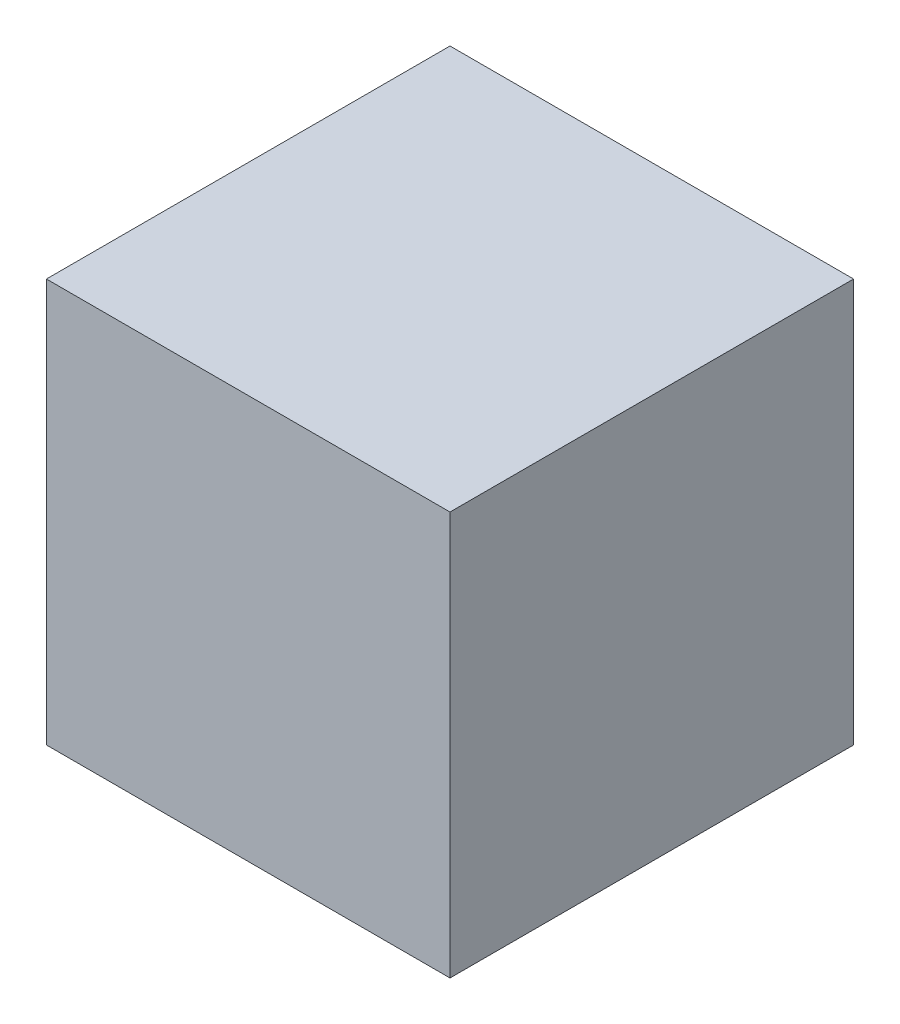
ISO-10303-21;
HEADER;
FILE_DESCRIPTION(('STEP AP214'),'2;1');
FILE_NAME('part.step','',(''),(''),'','','');
FILE_SCHEMA(('AUTOMOTIVE_DESIGN { 1 0 10303 214 1 1 1 1 }'));
ENDSEC;
DATA;
#1=APPLICATION_CONTEXT('core data for automotive mechanical design processes');
#2=APPLICATION_PROTOCOL_DEFINITION('international standard','automotive_design',2000,#1);
#3=PRODUCT_CONTEXT('',#1,'mechanical');
#4=PRODUCT('Part','Part','',(#3));
#5=PRODUCT_RELATED_PRODUCT_CATEGORY('part','',(#4));
#6=PRODUCT_DEFINITION_FORMATION('','',#4);
#7=PRODUCT_DEFINITION_CONTEXT('part definition',#1,'design');
#8=PRODUCT_DEFINITION('design','',#6,#7);
#9=PRODUCT_DEFINITION_SHAPE('','',#8);
#10=(LENGTH_UNIT() NAMED_UNIT(*) SI_UNIT(.MILLI.,.METRE.));
#11=(NAMED_UNIT(*) PLANE_ANGLE_UNIT() SI_UNIT($,.RADIAN.));
#12=(NAMED_UNIT(*) SI_UNIT($,.STERADIAN.) SOLID_ANGLE_UNIT());
#13=UNCERTAINTY_MEASURE_WITH_UNIT(LENGTH_MEASURE(1.E-05),#10,'distance_accuracy_value','');
#14=(GEOMETRIC_REPRESENTATION_CONTEXT(3) GLOBAL_UNCERTAINTY_ASSIGNED_CONTEXT((#13)) GLOBAL_UNIT_ASSIGNED_CONTEXT((#10,
#11,#12)) REPRESENTATION_CONTEXT('',''));
#15=CARTESIAN_POINT('',(0.,0.,0.));
#16=DIRECTION('',(0.,0.,1.));
#17=DIRECTION('',(1.,0.,0.));
#18=AXIS2_PLACEMENT_3D('',#15,#16,#17);
#19=CARTESIAN_POINT('',(0.,152.4,0.));
#20=DIRECTION('',(0.,1.,0.));
#21=DIRECTION('',(0.,0.,1.));
#22=AXIS2_PLACEMENT_3D('',#19,#20,#21);
#23=PLANE('',#22);
#24=DIRECTION('',(1.,0.,0.));
#25=VECTOR('',#24,1.);
#26=CARTESIAN_POINT('',(-76.2,152.4,76.2));
#27=LINE('',#26,#25);
#28=CARTESIAN_POINT('',(76.2,152.4,76.2));
#29=VERTEX_POINT('',#28);
#30=CARTESIAN_POINT('',(-76.2,152.4,76.2));
#31=VERTEX_POINT('',#30);
#32=EDGE_CURVE('E74',#29,#31,#27,.F.);
#33=ORIENTED_EDGE('',*,*,#32,.F.);
#34=DIRECTION('',(0.,0.,-1.));
#35=VECTOR('',#34,1.);
#36=CARTESIAN_POINT('',(76.2,152.4,76.2));
#37=LINE('',#36,#35);
#38=CARTESIAN_POINT('',(76.2,152.4,-76.2));
#39=VERTEX_POINT('',#38);
#40=EDGE_CURVE('E56',#39,#29,#37,.F.);
#41=ORIENTED_EDGE('',*,*,#40,.F.);
#42=DIRECTION('',(-1.,0.,0.));
#43=VECTOR('',#42,1.);
#44=CARTESIAN_POINT('',(76.2,152.4,-76.2));
#45=LINE('',#44,#43);
#46=CARTESIAN_POINT('',(-76.2,152.4,-76.2));
#47=VERTEX_POINT('',#46);
#48=EDGE_CURVE('E18',#47,#39,#45,.F.);
#49=ORIENTED_EDGE('',*,*,#48,.F.);
#50=DIRECTION('',(0.,0.,1.));
#51=VECTOR('',#50,1.);
#52=CARTESIAN_POINT('',(-76.2,152.4,-76.2));
#53=LINE('',#52,#51);
#54=EDGE_CURVE('E53',#31,#47,#53,.F.);
#55=ORIENTED_EDGE('',*,*,#54,.F.);
#56=EDGE_LOOP('',(#33,#41,#49,#55));
#57=FACE_BOUND('',#56,.T.);
#58=ADVANCED_FACE('F15',(#57),#23,.T.);
#59=CARTESIAN_POINT('',(76.2,0.,-76.2));
#60=DIRECTION('',(0.,0.,-1.));
#61=DIRECTION('',(-1.,0.,0.));
#62=AXIS2_PLACEMENT_3D('',#59,#60,#61);
#63=PLANE('',#62);
#64=DIRECTION('',(0.,1.,0.));
#65=VECTOR('',#64,1.);
#66=CARTESIAN_POINT('',(-76.2,0.,-76.2));
#67=LINE('',#66,#65);
#68=CARTESIAN_POINT('',(-76.2,0.,-76.2));
#69=VERTEX_POINT('',#68);
#70=EDGE_CURVE('E61',#47,#69,#67,.F.);
#71=ORIENTED_EDGE('',*,*,#70,.F.);
#72=ORIENTED_EDGE('',*,*,#48,.T.);
#73=DIRECTION('',(0.,1.,0.));
#74=VECTOR('',#73,1.);
#75=CARTESIAN_POINT('',(76.2,0.,-76.2));
#76=LINE('',#75,#74);
#77=CARTESIAN_POINT('',(76.2,0.,-76.2));
#78=VERTEX_POINT('',#77);
#79=EDGE_CURVE('E77',#78,#39,#76,.T.);
#80=ORIENTED_EDGE('',*,*,#79,.F.);
#81=DIRECTION('',(1.,0.,0.));
#82=VECTOR('',#81,1.);
#83=CARTESIAN_POINT('',(0.,0.,-76.2));
#84=LINE('',#83,#82);
#85=EDGE_CURVE('E71',#78,#69,#84,.F.);
#86=ORIENTED_EDGE('',*,*,#85,.T.);
#87=EDGE_LOOP('',(#71,#72,#80,#86));
#88=FACE_BOUND('',#87,.T.);
#89=ADVANCED_FACE('F70',(#88),#63,.T.);
#90=CARTESIAN_POINT('',(-76.2,0.,-76.2));
#91=DIRECTION('',(-1.,0.,0.));
#92=DIRECTION('',(0.,0.,1.));
#93=AXIS2_PLACEMENT_3D('',#90,#91,#92);
#94=PLANE('',#93);
#95=DIRECTION('',(0.,1.,0.));
#96=VECTOR('',#95,1.);
#97=CARTESIAN_POINT('',(-76.2,0.,76.2));
#98=LINE('',#97,#96);
#99=CARTESIAN_POINT('',(-76.2,0.,76.2));
#100=VERTEX_POINT('',#99);
#101=EDGE_CURVE('E67',#31,#100,#98,.F.);
#102=ORIENTED_EDGE('',*,*,#101,.F.);
#103=ORIENTED_EDGE('',*,*,#54,.T.);
#104=ORIENTED_EDGE('',*,*,#70,.T.);
#105=DIRECTION('',(0.,0.,1.));
#106=VECTOR('',#105,1.);
#107=CARTESIAN_POINT('',(-76.2,0.,0.));
#108=LINE('',#107,#106);
#109=EDGE_CURVE('E81',#69,#100,#108,.T.);
#110=ORIENTED_EDGE('',*,*,#109,.T.);
#111=EDGE_LOOP('',(#102,#103,#104,#110));
#112=FACE_BOUND('',#111,.T.);
#113=ADVANCED_FACE('F64',(#112),#94,.T.);
#114=CARTESIAN_POINT('',(-76.2,0.,76.2));
#115=DIRECTION('',(0.,0.,1.));
#116=DIRECTION('',(1.,0.,0.));
#117=AXIS2_PLACEMENT_3D('',#114,#115,#116);
#118=PLANE('',#117);
#119=DIRECTION('',(0.,1.,0.));
#120=VECTOR('',#119,1.);
#121=CARTESIAN_POINT('',(76.2,0.,76.2));
#122=LINE('',#121,#120);
#123=CARTESIAN_POINT('',(76.2,0.,76.2));
#124=VERTEX_POINT('',#123);
#125=EDGE_CURVE('E32',#29,#124,#122,.F.);
#126=ORIENTED_EDGE('',*,*,#125,.F.);
#127=ORIENTED_EDGE('',*,*,#32,.T.);
#128=ORIENTED_EDGE('',*,*,#101,.T.);
#129=DIRECTION('',(1.,0.,0.));
#130=VECTOR('',#129,1.);
#131=CARTESIAN_POINT('',(0.,0.,76.2));
#132=LINE('',#131,#130);
#133=EDGE_CURVE('E24',#100,#124,#132,.T.);
#134=ORIENTED_EDGE('',*,*,#133,.T.);
#135=EDGE_LOOP('',(#126,#127,#128,#134));
#136=FACE_BOUND('',#135,.T.);
#137=ADVANCED_FACE('F86',(#136),#118,.T.);
#138=CARTESIAN_POINT('',(76.2,0.,76.2));
#139=DIRECTION('',(1.,0.,0.));
#140=DIRECTION('',(0.,0.,-1.));
#141=AXIS2_PLACEMENT_3D('',#138,#139,#140);
#142=PLANE('',#141);
#143=ORIENTED_EDGE('',*,*,#79,.T.);
#144=ORIENTED_EDGE('',*,*,#40,.T.);
#145=ORIENTED_EDGE('',*,*,#125,.T.);
#146=DIRECTION('',(0.,0.,1.));
#147=VECTOR('',#146,1.);
#148=CARTESIAN_POINT('',(76.2,0.,0.));
#149=LINE('',#148,#147);
#150=EDGE_CURVE('E10',#124,#78,#149,.F.);
#151=ORIENTED_EDGE('',*,*,#150,.T.);
#152=EDGE_LOOP('',(#143,#144,#145,#151));
#153=FACE_BOUND('',#152,.T.);
#154=ADVANCED_FACE('F89',(#153),#142,.T.);
#155=CARTESIAN_POINT('',(0.,0.,0.));
#156=DIRECTION('',(0.,1.,0.));
#157=DIRECTION('',(0.,0.,1.));
#158=AXIS2_PLACEMENT_3D('',#155,#156,#157);
#159=PLANE('',#158);
#160=ORIENTED_EDGE('',*,*,#133,.F.);
#161=ORIENTED_EDGE('',*,*,#109,.F.);
#162=ORIENTED_EDGE('',*,*,#85,.F.);
#163=ORIENTED_EDGE('',*,*,#150,.F.);
#164=EDGE_LOOP('',(#160,#161,#162,#163));
#165=FACE_BOUND('',#164,.T.);
#166=ADVANCED_FACE('F88',(#165),#159,.F.);
#167=CLOSED_SHELL('',(#58,#89,#113,#137,#154,#166));
#168=MANIFOLD_SOLID_BREP('B1',#167);
#169=ADVANCED_BREP_SHAPE_REPRESENTATION('',(#18,#168),#14);
#170=SHAPE_DEFINITION_REPRESENTATION(#9,#169);
ENDSEC;
END-ISO-10303-21;
